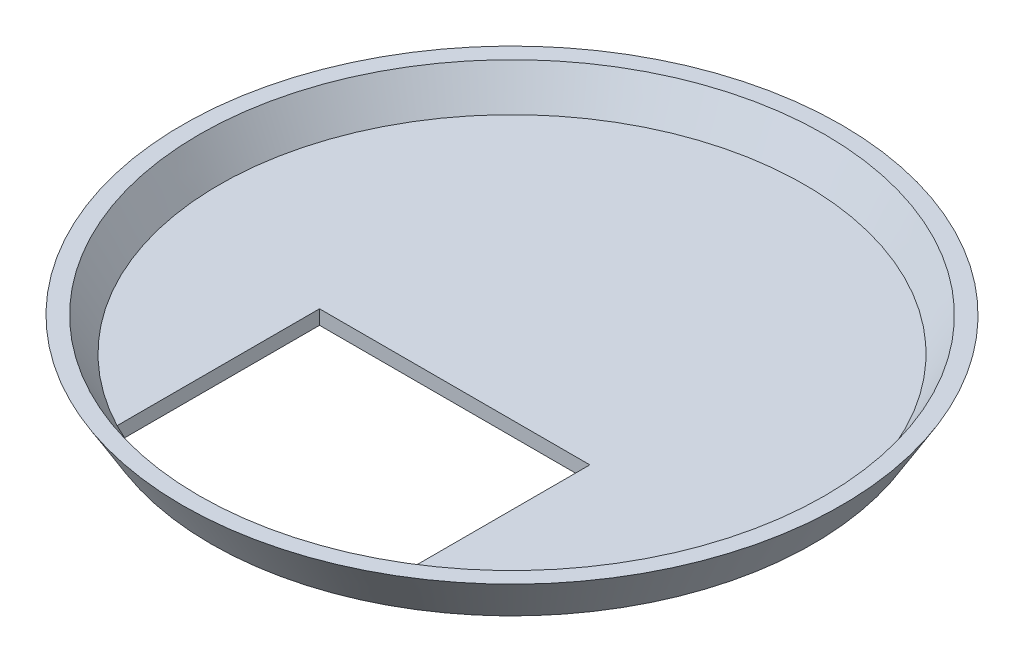
ISO-10303-21;
HEADER;
FILE_DESCRIPTION(('STEP AP214'),'2;1');
FILE_NAME('part.step','',(''),(''),'','','');
FILE_SCHEMA(('AUTOMOTIVE_DESIGN { 1 0 10303 214 1 1 1 1 }'));
ENDSEC;
DATA;
#1=APPLICATION_CONTEXT('core data for automotive mechanical design processes');
#2=APPLICATION_PROTOCOL_DEFINITION('international standard','automotive_design',2000,#1);
#3=PRODUCT_CONTEXT('',#1,'mechanical');
#4=PRODUCT('Part','Part','',(#3));
#5=PRODUCT_RELATED_PRODUCT_CATEGORY('part','',(#4));
#6=PRODUCT_DEFINITION_FORMATION('','',#4);
#7=PRODUCT_DEFINITION_CONTEXT('part definition',#1,'design');
#8=PRODUCT_DEFINITION('design','',#6,#7);
#9=PRODUCT_DEFINITION_SHAPE('','',#8);
#10=(LENGTH_UNIT() NAMED_UNIT(*) SI_UNIT(.MILLI.,.METRE.));
#11=(NAMED_UNIT(*) PLANE_ANGLE_UNIT() SI_UNIT($,.RADIAN.));
#12=(NAMED_UNIT(*) SI_UNIT($,.STERADIAN.) SOLID_ANGLE_UNIT());
#13=UNCERTAINTY_MEASURE_WITH_UNIT(LENGTH_MEASURE(1.E-05),#10,'distance_accuracy_value','');
#14=(GEOMETRIC_REPRESENTATION_CONTEXT(3) GLOBAL_UNCERTAINTY_ASSIGNED_CONTEXT((#13)) GLOBAL_UNIT_ASSIGNED_CONTEXT((#10,
#11,#12)) REPRESENTATION_CONTEXT('',''));
#15=CARTESIAN_POINT('',(0.,0.,0.));
#16=DIRECTION('',(0.,0.,1.));
#17=DIRECTION('',(1.,0.,0.));
#18=AXIS2_PLACEMENT_3D('',#15,#16,#17);
#19=CARTESIAN_POINT('',(0.,3.,0.));
#20=DIRECTION('',(0.,1.,0.));
#21=DIRECTION('',(0.,0.,1.));
#22=AXIS2_PLACEMENT_3D('',#19,#20,#21);
#23=PLANE('',#22);
#24=DIRECTION('',(0.,0.,1.));
#25=VECTOR('',#24,1.);
#26=CARTESIAN_POINT('',(-28.3,3.,12.));
#27=LINE('',#26,#25);
#28=CARTESIAN_POINT('',(-28.3,3.,12.));
#29=VERTEX_POINT('',#28);
#30=CARTESIAN_POINT('',(-28.3,3.,54.3780762868348));
#31=VERTEX_POINT('',#30);
#32=EDGE_CURVE('E103',#29,#31,#27,.T.);
#33=ORIENTED_EDGE('',*,*,#32,.F.);
#34=DIRECTION('',(-1.,0.,0.));
#35=VECTOR('',#34,1.);
#36=CARTESIAN_POINT('',(-28.3,3.,12.));
#37=LINE('',#36,#35);
#38=CARTESIAN_POINT('',(28.3,3.,12.));
#39=VERTEX_POINT('',#38);
#40=EDGE_CURVE('E85',#39,#29,#37,.T.);
#41=ORIENTED_EDGE('',*,*,#40,.F.);
#42=DIRECTION('',(0.,0.,-1.));
#43=VECTOR('',#42,1.);
#44=CARTESIAN_POINT('',(28.3,3.,12.));
#45=LINE('',#44,#43);
#46=CARTESIAN_POINT('',(28.3,3.,54.3780762868348));
#47=VERTEX_POINT('',#46);
#48=EDGE_CURVE('E100',#47,#39,#45,.T.);
#49=ORIENTED_EDGE('',*,*,#48,.F.);
#50=CARTESIAN_POINT('',(0.,3.,0.));
#51=DIRECTION('',(0.,-1.,0.));
#52=DIRECTION('',(0.,0.,-1.));
#53=AXIS2_PLACEMENT_3D('',#50,#51,#52);
#54=CIRCLE('',#53,61.3014288630928);
#55=EDGE_CURVE('E48',#31,#47,#54,.T.);
#56=ORIENTED_EDGE('',*,*,#55,.F.);
#57=EDGE_LOOP('',(#33,#41,#49,#56));
#58=FACE_BOUND('',#57,.T.);
#59=ADVANCED_FACE('F41',(#58),#23,.T.);
#60=CARTESIAN_POINT('',(0.,10.,0.));
#61=DIRECTION('',(0.,1.,0.));
#62=DIRECTION('',(0.,0.,1.));
#63=AXIS2_PLACEMENT_3D('',#60,#61,#62);
#64=CONICAL_SURFACE('',#63,65.5014288630928,0.540419500270584);
#65=EDGE_CURVE('E11',#47,#31,#54,.T.);
#66=ORIENTED_EDGE('',*,*,#65,.T.);
#67=ORIENTED_EDGE('',*,*,#55,.T.);
#68=EDGE_LOOP('',(#66,#67));
#69=FACE_BOUND('',#68,.T.);
#70=CARTESIAN_POINT('',(0.,10.,0.));
#71=DIRECTION('',(0.,-1.,0.));
#72=DIRECTION('',(0.,0.,-1.));
#73=AXIS2_PLACEMENT_3D('',#70,#71,#72);
#74=CIRCLE('',#73,65.5014288630928);
#75=CARTESIAN_POINT('',(0.,10.,-65.5014288630928));
#76=VERTEX_POINT('',#75);
#77=EDGE_CURVE('E120',#76,#76,#74,.T.);
#78=ORIENTED_EDGE('',*,*,#77,.F.);
#79=EDGE_LOOP('',(#78));
#80=FACE_BOUND('',#79,.T.);
#81=ADVANCED_FACE('F127',(#69,#80),#64,.F.);
#82=CARTESIAN_POINT('',(69.,10.,0.));
#83=DIRECTION('',(0.,1.,0.));
#84=DIRECTION('',(0.,0.,1.));
#85=AXIS2_PLACEMENT_3D('',#82,#83,#84);
#86=PLANE('',#85);
#87=ORIENTED_EDGE('',*,*,#77,.T.);
#88=EDGE_LOOP('',(#87));
#89=FACE_BOUND('',#88,.T.);
#90=CARTESIAN_POINT('',(0.,10.,0.));
#91=DIRECTION('',(0.,-1.,0.));
#92=DIRECTION('',(0.,0.,-1.));
#93=AXIS2_PLACEMENT_3D('',#90,#91,#92);
#94=CIRCLE('',#93,69.);
#95=CARTESIAN_POINT('',(0.,10.,-69.));
#96=VERTEX_POINT('',#95);
#97=EDGE_CURVE('E118',#96,#96,#94,.T.);
#98=ORIENTED_EDGE('',*,*,#97,.F.);
#99=EDGE_LOOP('',(#98));
#100=FACE_BOUND('',#99,.T.);
#101=ADVANCED_FACE('F147',(#89,#100),#86,.T.);
#102=CARTESIAN_POINT('',(0.,0.,0.));
#103=DIRECTION('',(0.,1.,0.));
#104=DIRECTION('',(0.,0.,1.));
#105=AXIS2_PLACEMENT_3D('',#102,#103,#104);
#106=CONICAL_SURFACE('',#105,63.,0.540419500270584);
#107=ORIENTED_EDGE('',*,*,#97,.T.);
#108=EDGE_LOOP('',(#107));
#109=FACE_BOUND('',#108,.T.);
#110=CARTESIAN_POINT('',(0.,0.,0.));
#111=DIRECTION('',(0.,-1.,0.));
#112=DIRECTION('',(0.,0.,-1.));
#113=AXIS2_PLACEMENT_3D('',#110,#111,#112);
#114=CIRCLE('',#113,63.);
#115=CARTESIAN_POINT('',(0.,0.,-63.));
#116=VERTEX_POINT('',#115);
#117=EDGE_CURVE('E112',#116,#116,#114,.T.);
#118=ORIENTED_EDGE('',*,*,#117,.F.);
#119=EDGE_LOOP('',(#118));
#120=FACE_BOUND('',#119,.T.);
#121=ADVANCED_FACE('F152',(#109,#120),#106,.T.);
#122=CARTESIAN_POINT('',(0.,0.,0.));
#123=DIRECTION('',(0.,-1.,0.));
#124=DIRECTION('',(0.,0.,-1.));
#125=AXIS2_PLACEMENT_3D('',#122,#123,#124);
#126=PLANE('',#125);
#127=DIRECTION('',(-1.,0.,0.));
#128=VECTOR('',#127,1.);
#129=CARTESIAN_POINT('',(-28.3,0.,12.));
#130=LINE('',#129,#128);
#131=CARTESIAN_POINT('',(28.3,0.,12.));
#132=VERTEX_POINT('',#131);
#133=CARTESIAN_POINT('',(-28.3,0.,12.));
#134=VERTEX_POINT('',#133);
#135=EDGE_CURVE('E82',#132,#134,#130,.T.);
#136=ORIENTED_EDGE('',*,*,#135,.T.);
#137=DIRECTION('',(0.,0.,1.));
#138=VECTOR('',#137,1.);
#139=CARTESIAN_POINT('',(-28.3,0.,12.));
#140=LINE('',#139,#138);
#141=CARTESIAN_POINT('',(-28.3,0.,54.3780762868348));
#142=VERTEX_POINT('',#141);
#143=EDGE_CURVE('E93',#134,#142,#140,.T.);
#144=ORIENTED_EDGE('',*,*,#143,.T.);
#145=CARTESIAN_POINT('',(0.,0.,0.));
#146=DIRECTION('',(0.,1.,0.));
#147=DIRECTION('',(0.,0.,1.));
#148=AXIS2_PLACEMENT_3D('',#145,#146,#147);
#149=CIRCLE('',#148,61.3014288630928);
#150=CARTESIAN_POINT('',(28.3,0.,54.3780762868348));
#151=VERTEX_POINT('',#150);
#152=EDGE_CURVE('E58',#142,#151,#149,.T.);
#153=ORIENTED_EDGE('',*,*,#152,.T.);
#154=DIRECTION('',(0.,0.,-1.));
#155=VECTOR('',#154,1.);
#156=CARTESIAN_POINT('',(28.3,0.,12.));
#157=LINE('',#156,#155);
#158=EDGE_CURVE('E90',#151,#132,#157,.T.);
#159=ORIENTED_EDGE('',*,*,#158,.T.);
#160=EDGE_LOOP('',(#136,#144,#153,#159));
#161=FACE_BOUND('',#160,.T.);
#162=ORIENTED_EDGE('',*,*,#117,.T.);
#163=EDGE_LOOP('',(#162));
#164=FACE_BOUND('',#163,.T.);
#165=ADVANCED_FACE('F97',(#161,#164),#126,.T.);
#166=CARTESIAN_POINT('',(-28.3,0.,12.));
#167=DIRECTION('',(0.,0.,-1.));
#168=DIRECTION('',(-1.,0.,0.));
#169=AXIS2_PLACEMENT_3D('',#166,#167,#168);
#170=PLANE('',#169);
#171=ORIENTED_EDGE('',*,*,#40,.T.);
#172=DIRECTION('',(0.,1.,0.));
#173=VECTOR('',#172,1.);
#174=CARTESIAN_POINT('',(-28.3,0.,12.));
#175=LINE('',#174,#173);
#176=EDGE_CURVE('E78',#134,#29,#175,.T.);
#177=ORIENTED_EDGE('',*,*,#176,.F.);
#178=ORIENTED_EDGE('',*,*,#135,.F.);
#179=DIRECTION('',(0.,1.,0.));
#180=VECTOR('',#179,1.);
#181=CARTESIAN_POINT('',(28.3,0.,12.));
#182=LINE('',#181,#180);
#183=EDGE_CURVE('E110',#132,#39,#182,.T.);
#184=ORIENTED_EDGE('',*,*,#183,.T.);
#185=EDGE_LOOP('',(#171,#177,#178,#184));
#186=FACE_BOUND('',#185,.T.);
#187=ADVANCED_FACE('F80',(#186),#170,.F.);
#188=CARTESIAN_POINT('',(28.3,0.,12.));
#189=DIRECTION('',(1.,0.,0.));
#190=DIRECTION('',(0.,0.,-1.));
#191=AXIS2_PLACEMENT_3D('',#188,#189,#190);
#192=PLANE('',#191);
#193=ORIENTED_EDGE('',*,*,#48,.T.);
#194=ORIENTED_EDGE('',*,*,#183,.F.);
#195=ORIENTED_EDGE('',*,*,#158,.F.);
#196=DIRECTION('',(0.,1.,0.));
#197=VECTOR('',#196,1.);
#198=CARTESIAN_POINT('',(28.3,0.,54.3780762868348));
#199=LINE('',#198,#197);
#200=EDGE_CURVE('E113',#151,#47,#199,.T.);
#201=ORIENTED_EDGE('',*,*,#200,.T.);
#202=EDGE_LOOP('',(#193,#194,#195,#201));
#203=FACE_BOUND('',#202,.T.);
#204=ADVANCED_FACE('F132',(#203),#192,.F.);
#205=CARTESIAN_POINT('',(0.,0.,0.));
#206=DIRECTION('',(0.,1.,0.));
#207=DIRECTION('',(0.,0.,1.));
#208=AXIS2_PLACEMENT_3D('',#205,#206,#207);
#209=CYLINDRICAL_SURFACE('',#208,61.3014288630928);
#210=ORIENTED_EDGE('',*,*,#65,.F.);
#211=ORIENTED_EDGE('',*,*,#200,.F.);
#212=ORIENTED_EDGE('',*,*,#152,.F.);
#213=DIRECTION('',(0.,1.,0.));
#214=VECTOR('',#213,1.);
#215=CARTESIAN_POINT('',(-28.3,0.,54.3780762868348));
#216=LINE('',#215,#214);
#217=EDGE_CURVE('E89',#142,#31,#216,.T.);
#218=ORIENTED_EDGE('',*,*,#217,.T.);
#219=EDGE_LOOP('',(#210,#211,#212,#218));
#220=FACE_BOUND('',#219,.T.);
#221=ADVANCED_FACE('F133',(#220),#209,.F.);
#222=CARTESIAN_POINT('',(-28.3,0.,12.));
#223=DIRECTION('',(-1.,0.,0.));
#224=DIRECTION('',(0.,0.,1.));
#225=AXIS2_PLACEMENT_3D('',#222,#223,#224);
#226=PLANE('',#225);
#227=ORIENTED_EDGE('',*,*,#32,.T.);
#228=ORIENTED_EDGE('',*,*,#217,.F.);
#229=ORIENTED_EDGE('',*,*,#143,.F.);
#230=ORIENTED_EDGE('',*,*,#176,.T.);
#231=EDGE_LOOP('',(#227,#228,#229,#230));
#232=FACE_BOUND('',#231,.T.);
#233=ADVANCED_FACE('F94',(#232),#226,.F.);
#234=CLOSED_SHELL('',(#59,#81,#101,#121,#165,#187,#204,#221,#233));
#235=MANIFOLD_SOLID_BREP('B2',#234);
#236=ADVANCED_BREP_SHAPE_REPRESENTATION('',(#18,#235),#14);
#237=SHAPE_DEFINITION_REPRESENTATION(#9,#236);
ENDSEC;
END-ISO-10303-21;
